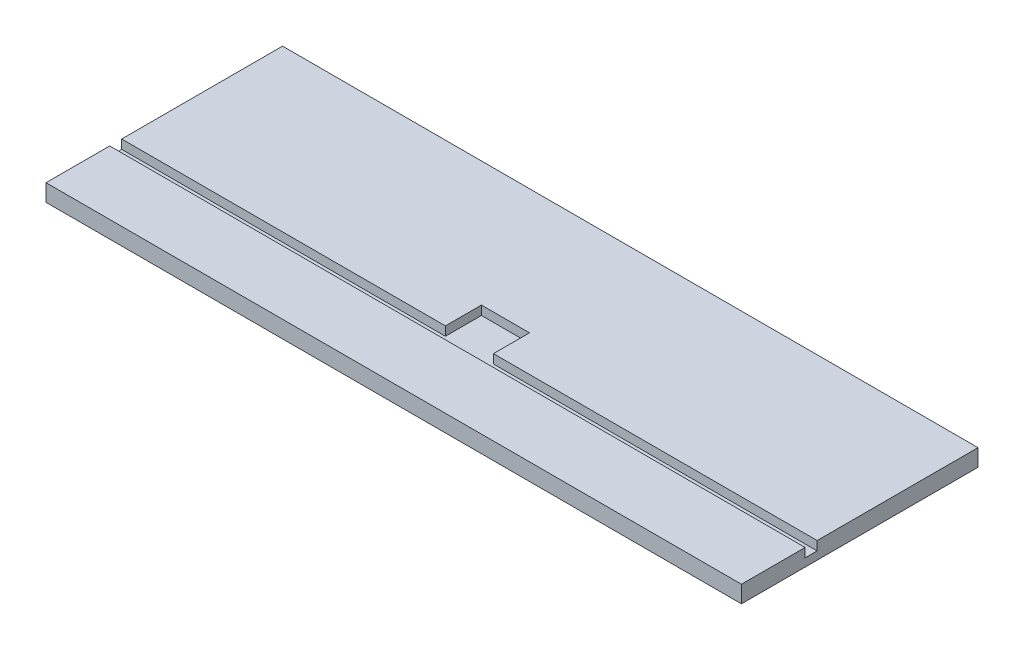
ISO-10303-21;
HEADER;
FILE_DESCRIPTION(('STEP AP214'),'2;1');
FILE_NAME('part.step','',(''),(''),'','','');
FILE_SCHEMA(('AUTOMOTIVE_DESIGN { 1 0 10303 214 1 1 1 1 }'));
ENDSEC;
DATA;
#1=APPLICATION_CONTEXT('core data for automotive mechanical design processes');
#2=APPLICATION_PROTOCOL_DEFINITION('international standard','automotive_design',2000,#1);
#3=PRODUCT_CONTEXT('',#1,'mechanical');
#4=PRODUCT('Part','Part','',(#3));
#5=PRODUCT_RELATED_PRODUCT_CATEGORY('part','',(#4));
#6=PRODUCT_DEFINITION_FORMATION('','',#4);
#7=PRODUCT_DEFINITION_CONTEXT('part definition',#1,'design');
#8=PRODUCT_DEFINITION('design','',#6,#7);
#9=PRODUCT_DEFINITION_SHAPE('','',#8);
#10=(LENGTH_UNIT() NAMED_UNIT(*) SI_UNIT(.MILLI.,.METRE.));
#11=(NAMED_UNIT(*) PLANE_ANGLE_UNIT() SI_UNIT($,.RADIAN.));
#12=(NAMED_UNIT(*) SI_UNIT($,.STERADIAN.) SOLID_ANGLE_UNIT());
#13=UNCERTAINTY_MEASURE_WITH_UNIT(LENGTH_MEASURE(1.E-05),#10,'distance_accuracy_value','');
#14=(GEOMETRIC_REPRESENTATION_CONTEXT(3) GLOBAL_UNCERTAINTY_ASSIGNED_CONTEXT((#13)) GLOBAL_UNIT_ASSIGNED_CONTEXT((#10,
#11,#12)) REPRESENTATION_CONTEXT('',''));
#15=CARTESIAN_POINT('',(0.,0.,0.));
#16=DIRECTION('',(0.,0.,1.));
#17=DIRECTION('',(1.,0.,0.));
#18=AXIS2_PLACEMENT_3D('',#15,#16,#17);
#19=CARTESIAN_POINT('',(0.,18.,0.));
#20=DIRECTION('',(0.,-1.,0.));
#21=DIRECTION('',(0.,0.,-1.));
#22=AXIS2_PLACEMENT_3D('',#19,#20,#21);
#23=PLANE('',#22);
#24=DIRECTION('',(0.,0.,1.));
#25=VECTOR('',#24,1.);
#26=CARTESIAN_POINT('',(-367.5,18.,125.));
#27=LINE('',#26,#25);
#28=CARTESIAN_POINT('',(-367.5,18.,-125.));
#29=VERTEX_POINT('',#28);
#30=CARTESIAN_POINT('',(-367.5,18.,45.));
#31=VERTEX_POINT('',#30);
#32=EDGE_CURVE('E200',#29,#31,#27,.T.);
#33=ORIENTED_EDGE('',*,*,#32,.T.);
#34=DIRECTION('',(-1.,0.,0.));
#35=VECTOR('',#34,1.);
#36=CARTESIAN_POINT('',(-390.644484972512,18.,45.));
#37=LINE('',#36,#35);
#38=CARTESIAN_POINT('',(-25.4,18.,45.));
#39=VERTEX_POINT('',#38);
#40=EDGE_CURVE('E177',#39,#31,#37,.T.);
#41=ORIENTED_EDGE('',*,*,#40,.F.);
#42=DIRECTION('',(0.,0.,1.));
#43=VECTOR('',#42,1.);
#44=CARTESIAN_POINT('',(-25.4,18.,45.));
#45=LINE('',#44,#43);
#46=CARTESIAN_POINT('',(-25.4,18.,6.89999999999996));
#47=VERTEX_POINT('',#46);
#48=EDGE_CURVE('E174',#47,#39,#45,.T.);
#49=ORIENTED_EDGE('',*,*,#48,.F.);
#50=DIRECTION('',(-1.,0.,0.));
#51=VECTOR('',#50,1.);
#52=CARTESIAN_POINT('',(-25.4,18.,6.89999999999996));
#53=LINE('',#52,#51);
#54=CARTESIAN_POINT('',(25.4,18.,6.89999999999996));
#55=VERTEX_POINT('',#54);
#56=EDGE_CURVE('E171',#55,#47,#53,.T.);
#57=ORIENTED_EDGE('',*,*,#56,.F.);
#58=DIRECTION('',(0.,0.,-1.));
#59=VECTOR('',#58,1.);
#60=CARTESIAN_POINT('',(25.4,18.,6.89999999999996));
#61=LINE('',#60,#59);
#62=CARTESIAN_POINT('',(25.4,18.,45.));
#63=VERTEX_POINT('',#62);
#64=EDGE_CURVE('E169',#63,#55,#61,.T.);
#65=ORIENTED_EDGE('',*,*,#64,.F.);
#66=DIRECTION('',(1.,0.,0.));
#67=VECTOR('',#66,1.);
#68=CARTESIAN_POINT('',(0.,18.,45.));
#69=LINE('',#68,#67);
#70=CARTESIAN_POINT('',(367.5,18.,45.));
#71=VERTEX_POINT('',#70);
#72=EDGE_CURVE('E43',#63,#71,#69,.T.);
#73=ORIENTED_EDGE('',*,*,#72,.T.);
#74=DIRECTION('',(0.,0.,-1.));
#75=VECTOR('',#74,1.);
#76=CARTESIAN_POINT('',(367.5,18.,125.));
#77=LINE('',#76,#75);
#78=CARTESIAN_POINT('',(367.5,18.,-125.));
#79=VERTEX_POINT('',#78);
#80=EDGE_CURVE('E88',#71,#79,#77,.T.);
#81=ORIENTED_EDGE('',*,*,#80,.T.);
#82=DIRECTION('',(-1.,0.,0.));
#83=VECTOR('',#82,1.);
#84=CARTESIAN_POINT('',(-367.5,18.,-125.));
#85=LINE('',#84,#83);
#86=EDGE_CURVE('E197',#79,#29,#85,.T.);
#87=ORIENTED_EDGE('',*,*,#86,.T.);
#88=EDGE_LOOP('',(#33,#41,#49,#57,#65,#73,#81,#87));
#89=FACE_BOUND('',#88,.T.);
#90=ADVANCED_FACE('F35',(#89),#23,.F.);
#91=CARTESIAN_POINT('',(367.5,18.,125.));
#92=DIRECTION('',(-1.,0.,0.));
#93=DIRECTION('',(0.,0.,1.));
#94=AXIS2_PLACEMENT_3D('',#91,#92,#93);
#95=PLANE('',#94);
#96=ORIENTED_EDGE('',*,*,#80,.F.);
#97=DIRECTION('',(0.,-1.,0.));
#98=VECTOR('',#97,1.);
#99=CARTESIAN_POINT('',(367.5,18.,45.));
#100=LINE('',#99,#98);
#101=CARTESIAN_POINT('',(367.5,8.475,45.));
#102=VERTEX_POINT('',#101);
#103=EDGE_CURVE('E188',#71,#102,#100,.T.);
#104=ORIENTED_EDGE('',*,*,#103,.T.);
#105=DIRECTION('',(0.,0.,-1.));
#106=VECTOR('',#105,1.);
#107=CARTESIAN_POINT('',(367.5,8.475,125.));
#108=LINE('',#107,#106);
#109=CARTESIAN_POINT('',(367.5,8.475,57.7));
#110=VERTEX_POINT('',#109);
#111=EDGE_CURVE('E143',#110,#102,#108,.T.);
#112=ORIENTED_EDGE('',*,*,#111,.F.);
#113=DIRECTION('',(0.,1.,0.));
#114=VECTOR('',#113,1.);
#115=CARTESIAN_POINT('',(367.5,18.,57.7));
#116=LINE('',#115,#114);
#117=CARTESIAN_POINT('',(367.5,18.,57.7));
#118=VERTEX_POINT('',#117);
#119=EDGE_CURVE('E185',#110,#118,#116,.T.);
#120=ORIENTED_EDGE('',*,*,#119,.T.);
#121=CARTESIAN_POINT('',(367.5,18.,125.));
#122=VERTEX_POINT('',#121);
#123=EDGE_CURVE('E195',#122,#118,#77,.T.);
#124=ORIENTED_EDGE('',*,*,#123,.F.);
#125=DIRECTION('',(0.,-1.,0.));
#126=VECTOR('',#125,1.);
#127=CARTESIAN_POINT('',(367.5,18.,125.));
#128=LINE('',#127,#126);
#129=CARTESIAN_POINT('',(367.5,0.,125.));
#130=VERTEX_POINT('',#129);
#131=EDGE_CURVE('E204',#122,#130,#128,.T.);
#132=ORIENTED_EDGE('',*,*,#131,.T.);
#133=DIRECTION('',(0.,0.,-1.));
#134=VECTOR('',#133,1.);
#135=CARTESIAN_POINT('',(367.5,0.,125.));
#136=LINE('',#135,#134);
#137=CARTESIAN_POINT('',(367.5,0.,-125.));
#138=VERTEX_POINT('',#137);
#139=EDGE_CURVE('E194',#130,#138,#136,.T.);
#140=ORIENTED_EDGE('',*,*,#139,.T.);
#141=DIRECTION('',(0.,-1.,0.));
#142=VECTOR('',#141,1.);
#143=CARTESIAN_POINT('',(367.5,18.,-125.));
#144=LINE('',#143,#142);
#145=EDGE_CURVE('E218',#79,#138,#144,.T.);
#146=ORIENTED_EDGE('',*,*,#145,.F.);
#147=EDGE_LOOP('',(#96,#104,#112,#120,#124,#132,#140,#146));
#148=FACE_BOUND('',#147,.T.);
#149=ADVANCED_FACE('F37',(#148),#95,.F.);
#150=CARTESIAN_POINT('',(-367.5,18.,-125.));
#151=DIRECTION('',(0.,0.,1.));
#152=DIRECTION('',(1.,0.,0.));
#153=AXIS2_PLACEMENT_3D('',#150,#151,#152);
#154=PLANE('',#153);
#155=DIRECTION('',(-1.,0.,0.));
#156=VECTOR('',#155,1.);
#157=CARTESIAN_POINT('',(-367.5,0.,-125.));
#158=LINE('',#157,#156);
#159=CARTESIAN_POINT('',(-367.5,0.,-125.));
#160=VERTEX_POINT('',#159);
#161=EDGE_CURVE('E207',#138,#160,#158,.T.);
#162=ORIENTED_EDGE('',*,*,#161,.T.);
#163=DIRECTION('',(0.,-1.,0.));
#164=VECTOR('',#163,1.);
#165=CARTESIAN_POINT('',(-367.5,18.,-125.));
#166=LINE('',#165,#164);
#167=EDGE_CURVE('E215',#29,#160,#166,.T.);
#168=ORIENTED_EDGE('',*,*,#167,.F.);
#169=ORIENTED_EDGE('',*,*,#86,.F.);
#170=ORIENTED_EDGE('',*,*,#145,.T.);
#171=EDGE_LOOP('',(#162,#168,#169,#170));
#172=FACE_BOUND('',#171,.T.);
#173=ADVANCED_FACE('F227',(#172),#154,.F.);
#174=CARTESIAN_POINT('',(-367.5,18.,125.));
#175=DIRECTION('',(1.,0.,0.));
#176=DIRECTION('',(0.,0.,-1.));
#177=AXIS2_PLACEMENT_3D('',#174,#175,#176);
#178=PLANE('',#177);
#179=DIRECTION('',(0.,0.,1.));
#180=VECTOR('',#179,1.);
#181=CARTESIAN_POINT('',(-367.5,8.475,125.));
#182=LINE('',#181,#180);
#183=CARTESIAN_POINT('',(-367.5,8.475,45.));
#184=VERTEX_POINT('',#183);
#185=CARTESIAN_POINT('',(-367.5,8.475,57.7));
#186=VERTEX_POINT('',#185);
#187=EDGE_CURVE('E11',#184,#186,#182,.T.);
#188=ORIENTED_EDGE('',*,*,#187,.F.);
#189=DIRECTION('',(0.,1.,0.));
#190=VECTOR('',#189,1.);
#191=CARTESIAN_POINT('',(-367.5,18.,45.));
#192=LINE('',#191,#190);
#193=EDGE_CURVE('E190',#184,#31,#192,.T.);
#194=ORIENTED_EDGE('',*,*,#193,.T.);
#195=ORIENTED_EDGE('',*,*,#32,.F.);
#196=ORIENTED_EDGE('',*,*,#167,.T.);
#197=DIRECTION('',(0.,0.,1.));
#198=VECTOR('',#197,1.);
#199=CARTESIAN_POINT('',(-367.5,0.,125.));
#200=LINE('',#199,#198);
#201=CARTESIAN_POINT('',(-367.5,0.,125.));
#202=VERTEX_POINT('',#201);
#203=EDGE_CURVE('E209',#160,#202,#200,.T.);
#204=ORIENTED_EDGE('',*,*,#203,.T.);
#205=DIRECTION('',(0.,-1.,0.));
#206=VECTOR('',#205,1.);
#207=CARTESIAN_POINT('',(-367.5,18.,125.));
#208=LINE('',#207,#206);
#209=CARTESIAN_POINT('',(-367.5,18.,125.));
#210=VERTEX_POINT('',#209);
#211=EDGE_CURVE('E213',#210,#202,#208,.T.);
#212=ORIENTED_EDGE('',*,*,#211,.F.);
#213=CARTESIAN_POINT('',(-367.5,18.,57.7));
#214=VERTEX_POINT('',#213);
#215=EDGE_CURVE('E199',#214,#210,#27,.T.);
#216=ORIENTED_EDGE('',*,*,#215,.F.);
#217=DIRECTION('',(0.,-1.,0.));
#218=VECTOR('',#217,1.);
#219=CARTESIAN_POINT('',(-367.5,18.,57.7));
#220=LINE('',#219,#218);
#221=EDGE_CURVE('E50',#214,#186,#220,.T.);
#222=ORIENTED_EDGE('',*,*,#221,.T.);
#223=EDGE_LOOP('',(#188,#194,#195,#196,#204,#212,#216,#222));
#224=FACE_BOUND('',#223,.T.);
#225=ADVANCED_FACE('F234',(#224),#178,.F.);
#226=CARTESIAN_POINT('',(-367.5,18.,125.));
#227=DIRECTION('',(0.,0.,-1.));
#228=DIRECTION('',(-1.,0.,0.));
#229=AXIS2_PLACEMENT_3D('',#226,#227,#228);
#230=PLANE('',#229);
#231=DIRECTION('',(1.,0.,0.));
#232=VECTOR('',#231,1.);
#233=CARTESIAN_POINT('',(-367.5,0.,125.));
#234=LINE('',#233,#232);
#235=EDGE_CURVE('E80',#202,#130,#234,.T.);
#236=ORIENTED_EDGE('',*,*,#235,.T.);
#237=ORIENTED_EDGE('',*,*,#131,.F.);
#238=DIRECTION('',(1.,0.,0.));
#239=VECTOR('',#238,1.);
#240=CARTESIAN_POINT('',(-367.5,18.,125.));
#241=LINE('',#240,#239);
#242=EDGE_CURVE('E59',#210,#122,#241,.T.);
#243=ORIENTED_EDGE('',*,*,#242,.F.);
#244=ORIENTED_EDGE('',*,*,#211,.T.);
#245=EDGE_LOOP('',(#236,#237,#243,#244));
#246=FACE_BOUND('',#245,.T.);
#247=ADVANCED_FACE('F265',(#246),#230,.F.);
#248=ORIENTED_EDGE('',*,*,#123,.T.);
#249=DIRECTION('',(-1.,0.,0.));
#250=VECTOR('',#249,1.);
#251=CARTESIAN_POINT('',(0.,18.,57.7));
#252=LINE('',#251,#250);
#253=EDGE_CURVE('E221',#118,#214,#252,.T.);
#254=ORIENTED_EDGE('',*,*,#253,.T.);
#255=ORIENTED_EDGE('',*,*,#215,.T.);
#256=ORIENTED_EDGE('',*,*,#242,.T.);
#257=EDGE_LOOP('',(#248,#254,#255,#256));
#258=FACE_BOUND('',#257,.T.);
#259=ADVANCED_FACE('F255',(#258),#23,.F.);
#260=CARTESIAN_POINT('',(0.,0.,0.));
#261=DIRECTION('',(0.,-1.,0.));
#262=DIRECTION('',(0.,0.,-1.));
#263=AXIS2_PLACEMENT_3D('',#260,#261,#262);
#264=PLANE('',#263);
#265=ORIENTED_EDGE('',*,*,#139,.F.);
#266=ORIENTED_EDGE('',*,*,#235,.F.);
#267=ORIENTED_EDGE('',*,*,#203,.F.);
#268=ORIENTED_EDGE('',*,*,#161,.F.);
#269=EDGE_LOOP('',(#265,#266,#267,#268));
#270=FACE_BOUND('',#269,.T.);
#271=ADVANCED_FACE('F264',(#270),#264,.T.);
#272=CARTESIAN_POINT('',(0.,8.475,0.));
#273=DIRECTION('',(0.,1.,0.));
#274=DIRECTION('',(0.,0.,1.));
#275=AXIS2_PLACEMENT_3D('',#272,#273,#274);
#276=PLANE('',#275);
#277=ORIENTED_EDGE('',*,*,#111,.T.);
#278=DIRECTION('',(-1.,0.,0.));
#279=VECTOR('',#278,1.);
#280=CARTESIAN_POINT('',(25.4,8.475,45.));
#281=LINE('',#280,#279);
#282=CARTESIAN_POINT('',(25.4,8.475,45.));
#283=VERTEX_POINT('',#282);
#284=EDGE_CURVE('E135',#102,#283,#281,.T.);
#285=ORIENTED_EDGE('',*,*,#284,.T.);
#286=DIRECTION('',(0.,0.,-1.));
#287=VECTOR('',#286,1.);
#288=CARTESIAN_POINT('',(25.4,8.475,6.89999999999996));
#289=LINE('',#288,#287);
#290=CARTESIAN_POINT('',(25.4,8.475,6.89999999999996));
#291=VERTEX_POINT('',#290);
#292=EDGE_CURVE('E140',#283,#291,#289,.T.);
#293=ORIENTED_EDGE('',*,*,#292,.T.);
#294=DIRECTION('',(-1.,0.,0.));
#295=VECTOR('',#294,1.);
#296=CARTESIAN_POINT('',(-25.4,8.475,6.89999999999996));
#297=LINE('',#296,#295);
#298=CARTESIAN_POINT('',(-25.4,8.475,6.89999999999996));
#299=VERTEX_POINT('',#298);
#300=EDGE_CURVE('E159',#291,#299,#297,.T.);
#301=ORIENTED_EDGE('',*,*,#300,.T.);
#302=DIRECTION('',(0.,0.,1.));
#303=VECTOR('',#302,1.);
#304=CARTESIAN_POINT('',(-25.4,8.475,45.));
#305=LINE('',#304,#303);
#306=CARTESIAN_POINT('',(-25.4,8.475,45.));
#307=VERTEX_POINT('',#306);
#308=EDGE_CURVE('E161',#299,#307,#305,.T.);
#309=ORIENTED_EDGE('',*,*,#308,.T.);
#310=DIRECTION('',(-1.,0.,0.));
#311=VECTOR('',#310,1.);
#312=CARTESIAN_POINT('',(-390.644484972512,8.475,45.));
#313=LINE('',#312,#311);
#314=EDGE_CURVE('E155',#307,#184,#313,.T.);
#315=ORIENTED_EDGE('',*,*,#314,.T.);
#316=ORIENTED_EDGE('',*,*,#187,.T.);
#317=DIRECTION('',(1.,0.,0.));
#318=VECTOR('',#317,1.);
#319=CARTESIAN_POINT('',(-390.644484972512,8.475,57.7));
#320=LINE('',#319,#318);
#321=EDGE_CURVE('E146',#186,#110,#320,.T.);
#322=ORIENTED_EDGE('',*,*,#321,.T.);
#323=EDGE_LOOP('',(#277,#285,#293,#301,#309,#315,#316,#322));
#324=FACE_BOUND('',#323,.T.);
#325=ADVANCED_FACE('F137',(#324),#276,.T.);
#326=CARTESIAN_POINT('',(-390.644484972512,8.475,45.));
#327=DIRECTION('',(0.,0.,-1.));
#328=DIRECTION('',(-1.,0.,0.));
#329=AXIS2_PLACEMENT_3D('',#326,#327,#328);
#330=PLANE('',#329);
#331=ORIENTED_EDGE('',*,*,#314,.F.);
#332=DIRECTION('',(0.,1.,0.));
#333=VECTOR('',#332,1.);
#334=CARTESIAN_POINT('',(-25.4,8.475,45.));
#335=LINE('',#334,#333);
#336=EDGE_CURVE('E179',#307,#39,#335,.T.);
#337=ORIENTED_EDGE('',*,*,#336,.T.);
#338=ORIENTED_EDGE('',*,*,#40,.T.);
#339=ORIENTED_EDGE('',*,*,#193,.F.);
#340=EDGE_LOOP('',(#331,#337,#338,#339));
#341=FACE_BOUND('',#340,.T.);
#342=ADVANCED_FACE('F238',(#341),#330,.F.);
#343=CARTESIAN_POINT('',(25.4,8.475,45.));
#344=DIRECTION('',(0.,0.,-1.));
#345=DIRECTION('',(-1.,0.,0.));
#346=AXIS2_PLACEMENT_3D('',#343,#344,#345);
#347=PLANE('',#346);
#348=ORIENTED_EDGE('',*,*,#72,.F.);
#349=DIRECTION('',(0.,1.,0.));
#350=VECTOR('',#349,1.);
#351=CARTESIAN_POINT('',(25.4,8.475,45.));
#352=LINE('',#351,#350);
#353=EDGE_CURVE('E149',#283,#63,#352,.T.);
#354=ORIENTED_EDGE('',*,*,#353,.F.);
#355=ORIENTED_EDGE('',*,*,#284,.F.);
#356=ORIENTED_EDGE('',*,*,#103,.F.);
#357=EDGE_LOOP('',(#348,#354,#355,#356));
#358=FACE_BOUND('',#357,.T.);
#359=ADVANCED_FACE('F150',(#358),#347,.F.);
#360=CARTESIAN_POINT('',(-390.644484972512,8.475,57.7));
#361=DIRECTION('',(0.,0.,1.));
#362=DIRECTION('',(1.,0.,0.));
#363=AXIS2_PLACEMENT_3D('',#360,#361,#362);
#364=PLANE('',#363);
#365=ORIENTED_EDGE('',*,*,#321,.F.);
#366=ORIENTED_EDGE('',*,*,#221,.F.);
#367=ORIENTED_EDGE('',*,*,#253,.F.);
#368=ORIENTED_EDGE('',*,*,#119,.F.);
#369=EDGE_LOOP('',(#365,#366,#367,#368));
#370=FACE_BOUND('',#369,.T.);
#371=ADVANCED_FACE('F251',(#370),#364,.F.);
#372=CARTESIAN_POINT('',(-25.4,8.475,45.));
#373=DIRECTION('',(-1.,0.,0.));
#374=DIRECTION('',(0.,0.,1.));
#375=AXIS2_PLACEMENT_3D('',#372,#373,#374);
#376=PLANE('',#375);
#377=ORIENTED_EDGE('',*,*,#48,.T.);
#378=ORIENTED_EDGE('',*,*,#336,.F.);
#379=ORIENTED_EDGE('',*,*,#308,.F.);
#380=DIRECTION('',(0.,1.,0.));
#381=VECTOR('',#380,1.);
#382=CARTESIAN_POINT('',(-25.4,8.475,6.89999999999996));
#383=LINE('',#382,#381);
#384=EDGE_CURVE('E181',#299,#47,#383,.T.);
#385=ORIENTED_EDGE('',*,*,#384,.T.);
#386=EDGE_LOOP('',(#377,#378,#379,#385));
#387=FACE_BOUND('',#386,.T.);
#388=ADVANCED_FACE('F241',(#387),#376,.F.);
#389=CARTESIAN_POINT('',(-25.4,8.475,6.89999999999996));
#390=DIRECTION('',(0.,0.,-1.));
#391=DIRECTION('',(-1.,0.,0.));
#392=AXIS2_PLACEMENT_3D('',#389,#390,#391);
#393=PLANE('',#392);
#394=ORIENTED_EDGE('',*,*,#56,.T.);
#395=ORIENTED_EDGE('',*,*,#384,.F.);
#396=ORIENTED_EDGE('',*,*,#300,.F.);
#397=DIRECTION('',(0.,1.,0.));
#398=VECTOR('',#397,1.);
#399=CARTESIAN_POINT('',(25.4,8.475,6.89999999999996));
#400=LINE('',#399,#398);
#401=EDGE_CURVE('E154',#291,#55,#400,.T.);
#402=ORIENTED_EDGE('',*,*,#401,.T.);
#403=EDGE_LOOP('',(#394,#395,#396,#402));
#404=FACE_BOUND('',#403,.T.);
#405=ADVANCED_FACE('F243',(#404),#393,.F.);
#406=CARTESIAN_POINT('',(25.4,8.475,6.89999999999996));
#407=DIRECTION('',(1.,0.,0.));
#408=DIRECTION('',(0.,0.,-1.));
#409=AXIS2_PLACEMENT_3D('',#406,#407,#408);
#410=PLANE('',#409);
#411=ORIENTED_EDGE('',*,*,#64,.T.);
#412=ORIENTED_EDGE('',*,*,#401,.F.);
#413=ORIENTED_EDGE('',*,*,#292,.F.);
#414=ORIENTED_EDGE('',*,*,#353,.T.);
#415=EDGE_LOOP('',(#411,#412,#413,#414));
#416=FACE_BOUND('',#415,.T.);
#417=ADVANCED_FACE('F157',(#416),#410,.F.);
#418=CLOSED_SHELL('',(#90,#149,#173,#225,#247,#259,#271,#325,#342,#359,#371,#388,#405,#417));
#419=MANIFOLD_SOLID_BREP('B2',#418);
#420=ADVANCED_BREP_SHAPE_REPRESENTATION('',(#18,#419),#14);
#421=SHAPE_DEFINITION_REPRESENTATION(#9,#420);
ENDSEC;
END-ISO-10303-21;
